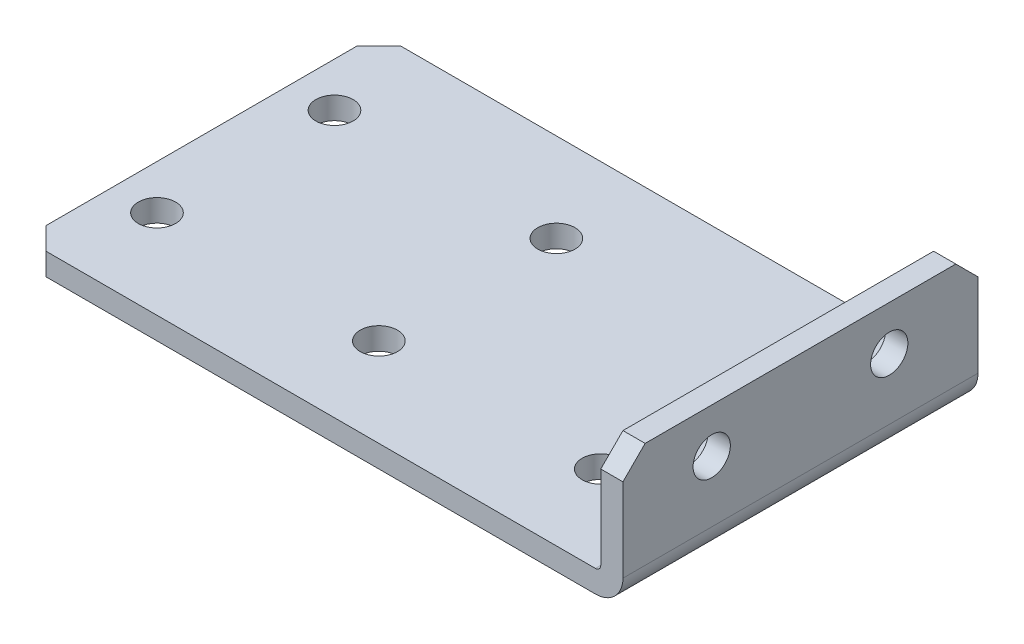
ISO-10303-21;
HEADER;
FILE_DESCRIPTION(('STEP AP214'),'2;1');
FILE_NAME('part.step','',(''),(''),'','','');
FILE_SCHEMA(('AUTOMOTIVE_DESIGN { 1 0 10303 214 1 1 1 1 }'));
ENDSEC;
DATA;
#1=APPLICATION_CONTEXT('core data for automotive mechanical design processes');
#2=APPLICATION_PROTOCOL_DEFINITION('international standard','automotive_design',2000,#1);
#3=PRODUCT_CONTEXT('',#1,'mechanical');
#4=PRODUCT('Part','Part','',(#3));
#5=PRODUCT_RELATED_PRODUCT_CATEGORY('part','',(#4));
#6=PRODUCT_DEFINITION_FORMATION('','',#4);
#7=PRODUCT_DEFINITION_CONTEXT('part definition',#1,'design');
#8=PRODUCT_DEFINITION('design','',#6,#7);
#9=PRODUCT_DEFINITION_SHAPE('','',#8);
#10=(LENGTH_UNIT() NAMED_UNIT(*) SI_UNIT(.MILLI.,.METRE.));
#11=(NAMED_UNIT(*) PLANE_ANGLE_UNIT() SI_UNIT($,.RADIAN.));
#12=(NAMED_UNIT(*) SI_UNIT($,.STERADIAN.) SOLID_ANGLE_UNIT());
#13=UNCERTAINTY_MEASURE_WITH_UNIT(LENGTH_MEASURE(1.E-05),#10,'distance_accuracy_value','');
#14=(GEOMETRIC_REPRESENTATION_CONTEXT(3) GLOBAL_UNCERTAINTY_ASSIGNED_CONTEXT((#13)) GLOBAL_UNIT_ASSIGNED_CONTEXT((#10,
#11,#12)) REPRESENTATION_CONTEXT('',''));
#15=CARTESIAN_POINT('',(0.,0.,0.));
#16=DIRECTION('',(0.,0.,1.));
#17=DIRECTION('',(1.,0.,0.));
#18=AXIS2_PLACEMENT_3D('',#15,#16,#17);
#19=CARTESIAN_POINT('',(85.7250000000001,12.7000000000001,-25.4));
#20=DIRECTION('',(-1.,0.,0.));
#21=DIRECTION('',(0.,-1.,0.));
#22=AXIS2_PLACEMENT_3D('',#19,#20,#21);
#23=CYLINDRICAL_SURFACE('',#22,2.667);
#24=CARTESIAN_POINT('',(85.7250000000001,12.7000000000001,-25.4));
#25=DIRECTION('',(-1.,0.,0.));
#26=DIRECTION('',(0.,-1.,0.));
#27=AXIS2_PLACEMENT_3D('',#24,#25,#26);
#28=CIRCLE('',#27,2.667);
#29=CARTESIAN_POINT('',(85.7250000000001,10.0330000000001,-25.4));
#30=VERTEX_POINT('',#29);
#31=EDGE_CURVE('E224',#30,#30,#28,.F.);
#32=ORIENTED_EDGE('',*,*,#31,.T.);
#33=EDGE_LOOP('',(#32));
#34=FACE_BOUND('',#33,.T.);
#35=CARTESIAN_POINT('',(82.55,12.7000000000001,-25.4));
#36=DIRECTION('',(-1.,0.,0.));
#37=DIRECTION('',(0.,-1.,0.));
#38=AXIS2_PLACEMENT_3D('',#35,#36,#37);
#39=CIRCLE('',#38,2.667);
#40=CARTESIAN_POINT('',(82.55,10.0330000000001,-25.4));
#41=VERTEX_POINT('',#40);
#42=EDGE_CURVE('E228',#41,#41,#39,.F.);
#43=ORIENTED_EDGE('',*,*,#42,.F.);
#44=EDGE_LOOP('',(#43));
#45=FACE_BOUND('',#44,.T.);
#46=ADVANCED_FACE('F16',(#34,#45),#23,.F.);
#47=CARTESIAN_POINT('',(85.7250000000001,12.7000000000001,-50.8));
#48=DIRECTION('',(-1.,0.,0.));
#49=DIRECTION('',(0.,-1.,0.));
#50=AXIS2_PLACEMENT_3D('',#47,#48,#49);
#51=CYLINDRICAL_SURFACE('',#50,2.667);
#52=CARTESIAN_POINT('',(85.7250000000001,12.7000000000001,-50.8));
#53=DIRECTION('',(-1.,0.,0.));
#54=DIRECTION('',(0.,-1.,0.));
#55=AXIS2_PLACEMENT_3D('',#52,#53,#54);
#56=CIRCLE('',#55,2.667);
#57=CARTESIAN_POINT('',(85.7250000000001,10.0330000000001,-50.8));
#58=VERTEX_POINT('',#57);
#59=EDGE_CURVE('E217',#58,#58,#56,.F.);
#60=ORIENTED_EDGE('',*,*,#59,.T.);
#61=EDGE_LOOP('',(#60));
#62=FACE_BOUND('',#61,.T.);
#63=CARTESIAN_POINT('',(82.55,12.7000000000001,-50.8));
#64=DIRECTION('',(-1.,0.,0.));
#65=DIRECTION('',(0.,-1.,0.));
#66=AXIS2_PLACEMENT_3D('',#63,#64,#65);
#67=CIRCLE('',#66,2.667);
#68=CARTESIAN_POINT('',(82.55,10.0330000000001,-50.8));
#69=VERTEX_POINT('',#68);
#70=EDGE_CURVE('E250',#69,#69,#67,.F.);
#71=ORIENTED_EDGE('',*,*,#70,.F.);
#72=EDGE_LOOP('',(#71));
#73=FACE_BOUND('',#72,.T.);
#74=ADVANCED_FACE('F423',(#62,#73),#51,.F.);
#75=CARTESIAN_POINT('',(85.7250000000001,19.05,0.));
#76=DIRECTION('',(0.,-1.,0.));
#77=DIRECTION('',(1.,0.,0.));
#78=AXIS2_PLACEMENT_3D('',#75,#76,#77);
#79=PLANE('',#78);
#80=DIRECTION('',(1.,0.,0.));
#81=VECTOR('',#80,1.);
#82=CARTESIAN_POINT('',(85.7250000000001,19.05,-60.325));
#83=LINE('',#82,#81);
#84=CARTESIAN_POINT('',(85.7250000000001,19.05,-60.325));
#85=VERTEX_POINT('',#84);
#86=CARTESIAN_POINT('',(82.5500000000001,19.05,-60.325));
#87=VERTEX_POINT('',#86);
#88=EDGE_CURVE('E241',#85,#87,#83,.F.);
#89=ORIENTED_EDGE('',*,*,#88,.T.);
#90=DIRECTION('',(0.,0.,1.));
#91=VECTOR('',#90,1.);
#92=CARTESIAN_POINT('',(82.5500000000001,19.05,0.));
#93=LINE('',#92,#91);
#94=CARTESIAN_POINT('',(82.55,19.05,-15.875));
#95=VERTEX_POINT('',#94);
#96=EDGE_CURVE('E251',#95,#87,#93,.F.);
#97=ORIENTED_EDGE('',*,*,#96,.F.);
#98=DIRECTION('',(1.,0.,0.));
#99=VECTOR('',#98,1.);
#100=CARTESIAN_POINT('',(85.7250000000001,19.05,-15.875));
#101=LINE('',#100,#99);
#102=CARTESIAN_POINT('',(85.7250000000001,19.05,-15.875));
#103=VERTEX_POINT('',#102);
#104=EDGE_CURVE('E225',#95,#103,#101,.T.);
#105=ORIENTED_EDGE('',*,*,#104,.T.);
#106=DIRECTION('',(0.,0.,1.));
#107=VECTOR('',#106,1.);
#108=CARTESIAN_POINT('',(85.7250000000001,19.05,0.));
#109=LINE('',#108,#107);
#110=EDGE_CURVE('E216',#103,#85,#109,.F.);
#111=ORIENTED_EDGE('',*,*,#110,.T.);
#112=EDGE_LOOP('',(#89,#97,#105,#111));
#113=FACE_BOUND('',#112,.T.);
#114=ADVANCED_FACE('F344',(#113),#79,.F.);
#115=CARTESIAN_POINT('',(85.7250000000001,19.05,-60.325));
#116=DIRECTION('',(0.,-0.707106781186548,0.707106781186548));
#117=DIRECTION('',(0.,-0.707106781186548,-0.707106781186548));
#118=AXIS2_PLACEMENT_3D('',#115,#116,#117);
#119=PLANE('',#118);
#120=DIRECTION('',(1.,0.,0.));
#121=VECTOR('',#120,1.);
#122=CARTESIAN_POINT('',(85.7250000000001,15.875,-63.5));
#123=LINE('',#122,#121);
#124=CARTESIAN_POINT('',(85.725,15.875,-63.5));
#125=VERTEX_POINT('',#124);
#126=CARTESIAN_POINT('',(82.55,15.875,-63.5));
#127=VERTEX_POINT('',#126);
#128=EDGE_CURVE('E137',#125,#127,#123,.F.);
#129=ORIENTED_EDGE('',*,*,#128,.T.);
#130=DIRECTION('',(0.,-0.707106781186545,-0.70710678118655));
#131=VECTOR('',#130,1.);
#132=CARTESIAN_POINT('',(82.5500000000001,19.05,-60.325));
#133=LINE('',#132,#131);
#134=EDGE_CURVE('E255',#87,#127,#133,.T.);
#135=ORIENTED_EDGE('',*,*,#134,.F.);
#136=ORIENTED_EDGE('',*,*,#88,.F.);
#137=DIRECTION('',(0.,-0.707106781186546,-0.707106781186549));
#138=VECTOR('',#137,1.);
#139=CARTESIAN_POINT('',(85.7250000000001,19.05,-60.325));
#140=LINE('',#139,#138);
#141=EDGE_CURVE('E234',#85,#125,#140,.T.);
#142=ORIENTED_EDGE('',*,*,#141,.T.);
#143=EDGE_LOOP('',(#129,#135,#136,#142));
#144=FACE_BOUND('',#143,.T.);
#145=ADVANCED_FACE('F341',(#144),#119,.F.);
#146=CARTESIAN_POINT('',(81.788,3.937,-63.5));
#147=DIRECTION('',(0.,0.,-1.));
#148=DIRECTION('',(-1.,0.,0.));
#149=AXIS2_PLACEMENT_3D('',#146,#147,#148);
#150=CYLINDRICAL_SURFACE('',#149,0.761999999999999);
#151=CARTESIAN_POINT('',(81.788,3.937,-12.7));
#152=DIRECTION('',(0.,0.,-1.));
#153=DIRECTION('',(-1.,0.,0.));
#154=AXIS2_PLACEMENT_3D('',#151,#152,#153);
#155=CIRCLE('',#154,0.761999999999999);
#156=CARTESIAN_POINT('',(82.55,3.937,-12.7));
#157=VERTEX_POINT('',#156);
#158=CARTESIAN_POINT('',(81.788,3.175,-12.7));
#159=VERTEX_POINT('',#158);
#160=EDGE_CURVE('E19',#157,#159,#155,.T.);
#161=ORIENTED_EDGE('',*,*,#160,.F.);
#162=DIRECTION('',(0.,0.,1.));
#163=VECTOR('',#162,1.);
#164=CARTESIAN_POINT('',(82.55,3.937,0.));
#165=LINE('',#164,#163);
#166=CARTESIAN_POINT('',(82.55,3.93699999999999,-63.5));
#167=VERTEX_POINT('',#166);
#168=EDGE_CURVE('E226',#167,#157,#165,.T.);
#169=ORIENTED_EDGE('',*,*,#168,.F.);
#170=CARTESIAN_POINT('',(81.788,3.937,-63.5));
#171=DIRECTION('',(0.,0.,-1.));
#172=DIRECTION('',(-1.,0.,0.));
#173=AXIS2_PLACEMENT_3D('',#170,#171,#172);
#174=CIRCLE('',#173,0.761999999999999);
#175=CARTESIAN_POINT('',(81.788,3.175,-63.5));
#176=VERTEX_POINT('',#175);
#177=EDGE_CURVE('E136',#167,#176,#174,.T.);
#178=ORIENTED_EDGE('',*,*,#177,.T.);
#179=DIRECTION('',(0.,0.,-1.));
#180=VECTOR('',#179,1.);
#181=CARTESIAN_POINT('',(81.788,3.175,-63.5));
#182=LINE('',#181,#180);
#183=EDGE_CURVE('E139',#176,#159,#182,.F.);
#184=ORIENTED_EDGE('',*,*,#183,.T.);
#185=EDGE_LOOP('',(#161,#169,#178,#184));
#186=FACE_BOUND('',#185,.T.);
#187=ADVANCED_FACE('F140',(#186),#150,.F.);
#188=CARTESIAN_POINT('',(82.5500000000001,19.05,0.));
#189=DIRECTION('',(-1.,0.,0.));
#190=DIRECTION('',(0.,-1.,0.));
#191=AXIS2_PLACEMENT_3D('',#188,#189,#190);
#192=PLANE('',#191);
#193=ORIENTED_EDGE('',*,*,#70,.T.);
#194=EDGE_LOOP('',(#193));
#195=FACE_BOUND('',#194,.T.);
#196=ORIENTED_EDGE('',*,*,#42,.T.);
#197=EDGE_LOOP('',(#196));
#198=FACE_BOUND('',#197,.T.);
#199=DIRECTION('',(0.,1.,0.));
#200=VECTOR('',#199,1.);
#201=CARTESIAN_POINT('',(82.55,0.,-12.7));
#202=LINE('',#201,#200);
#203=CARTESIAN_POINT('',(82.55,15.875,-12.7));
#204=VERTEX_POINT('',#203);
#205=EDGE_CURVE('E134',#157,#204,#202,.T.);
#206=ORIENTED_EDGE('',*,*,#205,.T.);
#207=DIRECTION('',(0.,0.707106781186549,-0.707106781186546));
#208=VECTOR('',#207,1.);
#209=CARTESIAN_POINT('',(82.55,19.05,-15.875));
#210=LINE('',#209,#208);
#211=EDGE_CURVE('E220',#204,#95,#210,.T.);
#212=ORIENTED_EDGE('',*,*,#211,.T.);
#213=ORIENTED_EDGE('',*,*,#96,.T.);
#214=ORIENTED_EDGE('',*,*,#134,.T.);
#215=DIRECTION('',(0.,-1.,0.));
#216=VECTOR('',#215,1.);
#217=CARTESIAN_POINT('',(82.5500000000001,19.05,-63.5));
#218=LINE('',#217,#216);
#219=EDGE_CURVE('E229',#127,#167,#218,.T.);
#220=ORIENTED_EDGE('',*,*,#219,.T.);
#221=ORIENTED_EDGE('',*,*,#168,.T.);
#222=EDGE_LOOP('',(#206,#212,#213,#214,#220,#221));
#223=FACE_BOUND('',#222,.T.);
#224=ADVANCED_FACE('F350',(#195,#198,#223),#192,.T.);
#225=CARTESIAN_POINT('',(85.7250000000001,19.05,-15.875));
#226=DIRECTION('',(0.,-0.707106781186546,-0.707106781186549));
#227=DIRECTION('',(0.,0.707106781186549,-0.707106781186546));
#228=AXIS2_PLACEMENT_3D('',#225,#226,#227);
#229=PLANE('',#228);
#230=DIRECTION('',(-1.,0.,0.));
#231=VECTOR('',#230,1.);
#232=CARTESIAN_POINT('',(-9.42940188980387,15.875,-12.7));
#233=LINE('',#232,#231);
#234=CARTESIAN_POINT('',(85.725,15.875,-12.7));
#235=VERTEX_POINT('',#234);
#236=EDGE_CURVE('E158',#204,#235,#233,.F.);
#237=ORIENTED_EDGE('',*,*,#236,.T.);
#238=DIRECTION('',(0.,0.707106781186549,-0.707106781186546));
#239=VECTOR('',#238,1.);
#240=CARTESIAN_POINT('',(85.725,15.875,-12.7));
#241=LINE('',#240,#239);
#242=EDGE_CURVE('E212',#235,#103,#241,.T.);
#243=ORIENTED_EDGE('',*,*,#242,.T.);
#244=ORIENTED_EDGE('',*,*,#104,.F.);
#245=ORIENTED_EDGE('',*,*,#211,.F.);
#246=EDGE_LOOP('',(#237,#243,#244,#245));
#247=FACE_BOUND('',#246,.T.);
#248=ADVANCED_FACE('F348',(#247),#229,.F.);
#249=CARTESIAN_POINT('',(85.7250000000001,19.05,0.));
#250=DIRECTION('',(-1.,0.,0.));
#251=DIRECTION('',(0.,-1.,0.));
#252=AXIS2_PLACEMENT_3D('',#249,#250,#251);
#253=PLANE('',#252);
#254=ORIENTED_EDGE('',*,*,#141,.F.);
#255=ORIENTED_EDGE('',*,*,#110,.F.);
#256=ORIENTED_EDGE('',*,*,#242,.F.);
#257=DIRECTION('',(0.,1.,0.));
#258=VECTOR('',#257,1.);
#259=CARTESIAN_POINT('',(85.725,0.,-12.7));
#260=LINE('',#259,#258);
#261=CARTESIAN_POINT('',(85.725,3.93699999999999,-12.7));
#262=VERTEX_POINT('',#261);
#263=EDGE_CURVE('E182',#235,#262,#260,.F.);
#264=ORIENTED_EDGE('',*,*,#263,.T.);
#265=DIRECTION('',(0.,0.,-1.));
#266=VECTOR('',#265,1.);
#267=CARTESIAN_POINT('',(85.725,3.93699999999999,-63.5));
#268=LINE('',#267,#266);
#269=CARTESIAN_POINT('',(85.725,3.93699999999999,-63.5));
#270=VERTEX_POINT('',#269);
#271=EDGE_CURVE('E161',#270,#262,#268,.F.);
#272=ORIENTED_EDGE('',*,*,#271,.F.);
#273=DIRECTION('',(0.,-1.,0.));
#274=VECTOR('',#273,1.);
#275=CARTESIAN_POINT('',(85.7250000000001,19.05,-63.5));
#276=LINE('',#275,#274);
#277=EDGE_CURVE('E146',#125,#270,#276,.T.);
#278=ORIENTED_EDGE('',*,*,#277,.F.);
#279=EDGE_LOOP('',(#254,#255,#256,#264,#272,#278));
#280=FACE_BOUND('',#279,.T.);
#281=ORIENTED_EDGE('',*,*,#59,.F.);
#282=EDGE_LOOP('',(#281));
#283=FACE_BOUND('',#282,.T.);
#284=ORIENTED_EDGE('',*,*,#31,.F.);
#285=EDGE_LOOP('',(#284));
#286=FACE_BOUND('',#285,.T.);
#287=ADVANCED_FACE('F326',(#280,#283,#286),#253,.F.);
#288=CARTESIAN_POINT('',(0.,3.175,-63.5));
#289=DIRECTION('',(0.,-1.,0.));
#290=DIRECTION('',(0.,0.,-1.));
#291=AXIS2_PLACEMENT_3D('',#288,#289,#290);
#292=PLANE('',#291);
#293=DIRECTION('',(0.707106781186548,0.,-0.707106781186548));
#294=VECTOR('',#293,1.);
#295=CARTESIAN_POINT('',(3.17500000000001,3.175,-63.5));
#296=LINE('',#295,#294);
#297=CARTESIAN_POINT('',(3.17500000000001,3.175,-63.5));
#298=VERTEX_POINT('',#297);
#299=CARTESIAN_POINT('',(0.,3.175,-60.325));
#300=VERTEX_POINT('',#299);
#301=EDGE_CURVE('E199',#298,#300,#296,.F.);
#302=ORIENTED_EDGE('',*,*,#301,.T.);
#303=DIRECTION('',(0.,0.,-1.));
#304=VECTOR('',#303,1.);
#305=CARTESIAN_POINT('',(0.,3.175,0.));
#306=LINE('',#305,#304);
#307=CARTESIAN_POINT('',(0.,3.175,-15.875));
#308=VERTEX_POINT('',#307);
#309=EDGE_CURVE('E145',#300,#308,#306,.F.);
#310=ORIENTED_EDGE('',*,*,#309,.T.);
#311=DIRECTION('',(-0.707106781186548,0.,-0.707106781186547));
#312=VECTOR('',#311,1.);
#313=CARTESIAN_POINT('',(3.17500000000001,3.175,-12.7));
#314=LINE('',#313,#312);
#315=CARTESIAN_POINT('',(3.17500000000001,3.175,-12.7));
#316=VERTEX_POINT('',#315);
#317=EDGE_CURVE('E151',#308,#316,#314,.F.);
#318=ORIENTED_EDGE('',*,*,#317,.T.);
#319=DIRECTION('',(-1.,0.,0.));
#320=VECTOR('',#319,1.);
#321=CARTESIAN_POINT('',(-9.42940188980387,3.175,-12.7));
#322=LINE('',#321,#320);
#323=EDGE_CURVE('E132',#316,#159,#322,.F.);
#324=ORIENTED_EDGE('',*,*,#323,.T.);
#325=ORIENTED_EDGE('',*,*,#183,.F.);
#326=DIRECTION('',(1.,0.,0.));
#327=VECTOR('',#326,1.);
#328=CARTESIAN_POINT('',(0.,3.175,-63.5));
#329=LINE('',#328,#327);
#330=EDGE_CURVE('E191',#176,#298,#329,.F.);
#331=ORIENTED_EDGE('',*,*,#330,.T.);
#332=EDGE_LOOP('',(#302,#310,#318,#324,#325,#331));
#333=FACE_BOUND('',#332,.T.);
#334=CARTESIAN_POINT('',(6.34999999999999,3.175,-50.8));
#335=DIRECTION('',(0.,1.,0.));
#336=DIRECTION('',(0.,0.,1.));
#337=AXIS2_PLACEMENT_3D('',#334,#335,#336);
#338=CIRCLE('',#337,2.667);
#339=CARTESIAN_POINT('',(6.34999999999999,3.175,-48.133));
#340=VERTEX_POINT('',#339);
#341=EDGE_CURVE('E203',#340,#340,#338,.F.);
#342=ORIENTED_EDGE('',*,*,#341,.T.);
#343=EDGE_LOOP('',(#342));
#344=FACE_BOUND('',#343,.T.);
#345=CARTESIAN_POINT('',(6.35,3.175,-25.4));
#346=DIRECTION('',(0.,1.,0.));
#347=DIRECTION('',(0.,0.,1.));
#348=AXIS2_PLACEMENT_3D('',#345,#346,#347);
#349=CIRCLE('',#348,2.667);
#350=CARTESIAN_POINT('',(6.35,3.175,-22.733));
#351=VERTEX_POINT('',#350);
#352=EDGE_CURVE('E282',#351,#351,#349,.F.);
#353=ORIENTED_EDGE('',*,*,#352,.T.);
#354=EDGE_LOOP('',(#353));
#355=FACE_BOUND('',#354,.T.);
#356=CARTESIAN_POINT('',(69.85,3.175,-50.8));
#357=DIRECTION('',(0.,1.,0.));
#358=DIRECTION('',(0.,0.,1.));
#359=AXIS2_PLACEMENT_3D('',#356,#357,#358);
#360=CIRCLE('',#359,2.667);
#361=CARTESIAN_POINT('',(69.85,3.175,-48.133));
#362=VERTEX_POINT('',#361);
#363=EDGE_CURVE('E286',#362,#362,#360,.F.);
#364=ORIENTED_EDGE('',*,*,#363,.T.);
#365=EDGE_LOOP('',(#364));
#366=FACE_BOUND('',#365,.T.);
#367=CARTESIAN_POINT('',(69.85,3.175,-25.4));
#368=DIRECTION('',(0.,1.,0.));
#369=DIRECTION('',(0.,0.,1.));
#370=AXIS2_PLACEMENT_3D('',#367,#368,#369);
#371=CIRCLE('',#370,2.667);
#372=CARTESIAN_POINT('',(69.85,3.175,-22.733));
#373=VERTEX_POINT('',#372);
#374=EDGE_CURVE('E290',#373,#373,#371,.F.);
#375=ORIENTED_EDGE('',*,*,#374,.T.);
#376=EDGE_LOOP('',(#375));
#377=FACE_BOUND('',#376,.T.);
#378=CARTESIAN_POINT('',(38.1,3.175,-50.8));
#379=DIRECTION('',(0.,1.,0.));
#380=DIRECTION('',(0.,0.,1.));
#381=AXIS2_PLACEMENT_3D('',#378,#379,#380);
#382=CIRCLE('',#381,2.667);
#383=CARTESIAN_POINT('',(38.1,3.175,-48.133));
#384=VERTEX_POINT('',#383);
#385=EDGE_CURVE('E294',#384,#384,#382,.F.);
#386=ORIENTED_EDGE('',*,*,#385,.T.);
#387=EDGE_LOOP('',(#386));
#388=FACE_BOUND('',#387,.T.);
#389=CARTESIAN_POINT('',(38.1,3.175,-25.4));
#390=DIRECTION('',(0.,1.,0.));
#391=DIRECTION('',(0.,0.,1.));
#392=AXIS2_PLACEMENT_3D('',#389,#390,#391);
#393=CIRCLE('',#392,2.667);
#394=CARTESIAN_POINT('',(38.1,3.175,-22.733));
#395=VERTEX_POINT('',#394);
#396=EDGE_CURVE('E211',#395,#395,#393,.F.);
#397=ORIENTED_EDGE('',*,*,#396,.T.);
#398=EDGE_LOOP('',(#397));
#399=FACE_BOUND('',#398,.T.);
#400=ADVANCED_FACE('F148',(#333,#344,#355,#366,#377,#388,#399),#292,.F.);
#401=CARTESIAN_POINT('',(0.,3.175,0.));
#402=DIRECTION('',(1.,0.,0.));
#403=DIRECTION('',(0.,0.,-1.));
#404=AXIS2_PLACEMENT_3D('',#401,#402,#403);
#405=PLANE('',#404);
#406=DIRECTION('',(0.,1.,0.));
#407=VECTOR('',#406,1.);
#408=CARTESIAN_POINT('',(0.,3.175,-60.325));
#409=LINE('',#408,#407);
#410=CARTESIAN_POINT('',(0.,0.,-60.325));
#411=VERTEX_POINT('',#410);
#412=EDGE_CURVE('E196',#300,#411,#409,.F.);
#413=ORIENTED_EDGE('',*,*,#412,.T.);
#414=DIRECTION('',(0.,0.,-1.));
#415=VECTOR('',#414,1.);
#416=CARTESIAN_POINT('',(0.,0.,-63.5));
#417=LINE('',#416,#415);
#418=CARTESIAN_POINT('',(0.,0.,-15.875));
#419=VERTEX_POINT('',#418);
#420=EDGE_CURVE('E195',#419,#411,#417,.T.);
#421=ORIENTED_EDGE('',*,*,#420,.F.);
#422=DIRECTION('',(0.,1.,0.));
#423=VECTOR('',#422,1.);
#424=CARTESIAN_POINT('',(0.,0.,-15.875));
#425=LINE('',#424,#423);
#426=EDGE_CURVE('E181',#419,#308,#425,.T.);
#427=ORIENTED_EDGE('',*,*,#426,.T.);
#428=ORIENTED_EDGE('',*,*,#309,.F.);
#429=EDGE_LOOP('',(#413,#421,#427,#428));
#430=FACE_BOUND('',#429,.T.);
#431=ADVANCED_FACE('F359',(#430),#405,.F.);
#432=CARTESIAN_POINT('',(3.17500000000001,3.175,-63.5));
#433=DIRECTION('',(0.707106781186548,0.,0.707106781186548));
#434=DIRECTION('',(0.707106781186548,0.,-0.707106781186548));
#435=AXIS2_PLACEMENT_3D('',#432,#433,#434);
#436=PLANE('',#435);
#437=ORIENTED_EDGE('',*,*,#412,.F.);
#438=ORIENTED_EDGE('',*,*,#301,.F.);
#439=DIRECTION('',(0.,1.,0.));
#440=VECTOR('',#439,1.);
#441=CARTESIAN_POINT('',(3.17500000000001,3.175,-63.5));
#442=LINE('',#441,#440);
#443=CARTESIAN_POINT('',(3.17500000000001,0.,-63.5));
#444=VERTEX_POINT('',#443);
#445=EDGE_CURVE('E187',#298,#444,#442,.F.);
#446=ORIENTED_EDGE('',*,*,#445,.T.);
#447=DIRECTION('',(0.707106781186547,0.,-0.707106781186548));
#448=VECTOR('',#447,1.);
#449=CARTESIAN_POINT('',(0.,0.,-60.325));
#450=LINE('',#449,#448);
#451=EDGE_CURVE('E186',#411,#444,#450,.T.);
#452=ORIENTED_EDGE('',*,*,#451,.F.);
#453=EDGE_LOOP('',(#437,#438,#446,#452));
#454=FACE_BOUND('',#453,.T.);
#455=ADVANCED_FACE('F355',(#454),#436,.F.);
#456=CARTESIAN_POINT('',(0.,3.175,-63.5));
#457=DIRECTION('',(0.,0.,1.));
#458=DIRECTION('',(1.,0.,0.));
#459=AXIS2_PLACEMENT_3D('',#456,#457,#458);
#460=PLANE('',#459);
#461=ORIENTED_EDGE('',*,*,#445,.F.);
#462=ORIENTED_EDGE('',*,*,#330,.F.);
#463=ORIENTED_EDGE('',*,*,#177,.F.);
#464=ORIENTED_EDGE('',*,*,#219,.F.);
#465=ORIENTED_EDGE('',*,*,#128,.F.);
#466=ORIENTED_EDGE('',*,*,#277,.T.);
#467=CARTESIAN_POINT('',(81.788,3.937,-63.5));
#468=DIRECTION('',(0.,0.,-1.));
#469=DIRECTION('',(-1.,0.,0.));
#470=AXIS2_PLACEMENT_3D('',#467,#468,#469);
#471=CIRCLE('',#470,3.937);
#472=CARTESIAN_POINT('',(81.788,0.,-63.5));
#473=VERTEX_POINT('',#472);
#474=EDGE_CURVE('E190',#473,#270,#471,.F.);
#475=ORIENTED_EDGE('',*,*,#474,.F.);
#476=DIRECTION('',(1.,0.,0.));
#477=VECTOR('',#476,1.);
#478=CARTESIAN_POINT('',(0.,0.,-63.5));
#479=LINE('',#478,#477);
#480=EDGE_CURVE('E170',#444,#473,#479,.T.);
#481=ORIENTED_EDGE('',*,*,#480,.F.);
#482=EDGE_LOOP('',(#461,#462,#463,#464,#465,#466,#475,#481));
#483=FACE_BOUND('',#482,.T.);
#484=ADVANCED_FACE('F336',(#483),#460,.F.);
#485=CARTESIAN_POINT('',(81.788,3.937,-63.5));
#486=DIRECTION('',(0.,0.,-1.));
#487=DIRECTION('',(-1.,0.,0.));
#488=AXIS2_PLACEMENT_3D('',#485,#486,#487);
#489=CYLINDRICAL_SURFACE('',#488,3.937);
#490=ORIENTED_EDGE('',*,*,#474,.T.);
#491=ORIENTED_EDGE('',*,*,#271,.T.);
#492=CARTESIAN_POINT('',(81.788,3.937,-12.7));
#493=DIRECTION('',(0.,0.,-1.));
#494=DIRECTION('',(-1.,0.,0.));
#495=AXIS2_PLACEMENT_3D('',#492,#493,#494);
#496=CIRCLE('',#495,3.937);
#497=CARTESIAN_POINT('',(81.788,0.,-12.7));
#498=VERTEX_POINT('',#497);
#499=EDGE_CURVE('E153',#262,#498,#496,.T.);
#500=ORIENTED_EDGE('',*,*,#499,.T.);
#501=DIRECTION('',(0.,0.,-1.));
#502=VECTOR('',#501,1.);
#503=CARTESIAN_POINT('',(81.788,0.,-63.5));
#504=LINE('',#503,#502);
#505=EDGE_CURVE('E165',#473,#498,#504,.F.);
#506=ORIENTED_EDGE('',*,*,#505,.F.);
#507=EDGE_LOOP('',(#490,#491,#500,#506));
#508=FACE_BOUND('',#507,.T.);
#509=ADVANCED_FACE('F332',(#508),#489,.T.);
#510=CARTESIAN_POINT('',(-9.42940188980387,0.,-12.7));
#511=DIRECTION('',(0.,0.,-1.));
#512=DIRECTION('',(-1.,0.,0.));
#513=AXIS2_PLACEMENT_3D('',#510,#511,#512);
#514=PLANE('',#513);
#515=ORIENTED_EDGE('',*,*,#236,.F.);
#516=ORIENTED_EDGE('',*,*,#205,.F.);
#517=ORIENTED_EDGE('',*,*,#160,.T.);
#518=ORIENTED_EDGE('',*,*,#323,.F.);
#519=DIRECTION('',(0.,1.,0.));
#520=VECTOR('',#519,1.);
#521=CARTESIAN_POINT('',(3.17500000000001,0.,-12.7));
#522=LINE('',#521,#520);
#523=CARTESIAN_POINT('',(3.17500000000001,0.,-12.7));
#524=VERTEX_POINT('',#523);
#525=EDGE_CURVE('E39',#316,#524,#522,.F.);
#526=ORIENTED_EDGE('',*,*,#525,.T.);
#527=DIRECTION('',(1.,0.,0.));
#528=VECTOR('',#527,1.);
#529=CARTESIAN_POINT('',(0.,0.,-12.7));
#530=LINE('',#529,#528);
#531=EDGE_CURVE('E169',#498,#524,#530,.F.);
#532=ORIENTED_EDGE('',*,*,#531,.F.);
#533=ORIENTED_EDGE('',*,*,#499,.F.);
#534=ORIENTED_EDGE('',*,*,#263,.F.);
#535=EDGE_LOOP('',(#515,#516,#517,#518,#526,#532,#533,#534));
#536=FACE_BOUND('',#535,.T.);
#537=ADVANCED_FACE('F130',(#536),#514,.F.);
#538=CARTESIAN_POINT('',(3.17500000000001,0.,-12.7));
#539=DIRECTION('',(0.707106781186547,0.,-0.707106781186548));
#540=DIRECTION('',(-0.707106781186548,0.,-0.707106781186547));
#541=AXIS2_PLACEMENT_3D('',#538,#539,#540);
#542=PLANE('',#541);
#543=ORIENTED_EDGE('',*,*,#426,.F.);
#544=DIRECTION('',(-0.707106781186547,0.,-0.707106781186548));
#545=VECTOR('',#544,1.);
#546=CARTESIAN_POINT('',(3.17500000000001,0.,-12.7));
#547=LINE('',#546,#545);
#548=EDGE_CURVE('E174',#524,#419,#547,.T.);
#549=ORIENTED_EDGE('',*,*,#548,.F.);
#550=ORIENTED_EDGE('',*,*,#525,.F.);
#551=ORIENTED_EDGE('',*,*,#317,.F.);
#552=EDGE_LOOP('',(#543,#549,#550,#551));
#553=FACE_BOUND('',#552,.T.);
#554=ADVANCED_FACE('F362',(#553),#542,.F.);
#555=CARTESIAN_POINT('',(38.1,0.,-25.4));
#556=DIRECTION('',(0.,1.,0.));
#557=DIRECTION('',(0.,0.,1.));
#558=AXIS2_PLACEMENT_3D('',#555,#556,#557);
#559=CYLINDRICAL_SURFACE('',#558,2.667);
#560=ORIENTED_EDGE('',*,*,#396,.F.);
#561=EDGE_LOOP('',(#560));
#562=FACE_BOUND('',#561,.T.);
#563=CARTESIAN_POINT('',(38.1,0.,-25.4));
#564=DIRECTION('',(0.,1.,0.));
#565=DIRECTION('',(0.,0.,1.));
#566=AXIS2_PLACEMENT_3D('',#563,#564,#565);
#567=CIRCLE('',#566,2.667);
#568=CARTESIAN_POINT('',(38.1,0.,-22.733));
#569=VERTEX_POINT('',#568);
#570=EDGE_CURVE('E178',#569,#569,#567,.T.);
#571=ORIENTED_EDGE('',*,*,#570,.F.);
#572=EDGE_LOOP('',(#571));
#573=FACE_BOUND('',#572,.T.);
#574=ADVANCED_FACE('F392',(#562,#573),#559,.F.);
#575=CARTESIAN_POINT('',(38.1,0.,-50.8));
#576=DIRECTION('',(0.,1.,0.));
#577=DIRECTION('',(0.,0.,1.));
#578=AXIS2_PLACEMENT_3D('',#575,#576,#577);
#579=CYLINDRICAL_SURFACE('',#578,2.667);
#580=ORIENTED_EDGE('',*,*,#385,.F.);
#581=EDGE_LOOP('',(#580));
#582=FACE_BOUND('',#581,.T.);
#583=CARTESIAN_POINT('',(38.1,0.,-50.8));
#584=DIRECTION('',(0.,1.,0.));
#585=DIRECTION('',(0.,0.,1.));
#586=AXIS2_PLACEMENT_3D('',#583,#584,#585);
#587=CIRCLE('',#586,2.667);
#588=CARTESIAN_POINT('',(38.1,0.,-48.133));
#589=VERTEX_POINT('',#588);
#590=EDGE_CURVE('E272',#589,#589,#587,.T.);
#591=ORIENTED_EDGE('',*,*,#590,.F.);
#592=EDGE_LOOP('',(#591));
#593=FACE_BOUND('',#592,.T.);
#594=ADVANCED_FACE('F388',(#582,#593),#579,.F.);
#595=CARTESIAN_POINT('',(69.85,0.,-25.4));
#596=DIRECTION('',(0.,1.,0.));
#597=DIRECTION('',(0.,0.,1.));
#598=AXIS2_PLACEMENT_3D('',#595,#596,#597);
#599=CYLINDRICAL_SURFACE('',#598,2.667);
#600=ORIENTED_EDGE('',*,*,#374,.F.);
#601=EDGE_LOOP('',(#600));
#602=FACE_BOUND('',#601,.T.);
#603=CARTESIAN_POINT('',(69.85,0.,-25.4));
#604=DIRECTION('',(0.,1.,0.));
#605=DIRECTION('',(0.,0.,1.));
#606=AXIS2_PLACEMENT_3D('',#603,#604,#605);
#607=CIRCLE('',#606,2.667);
#608=CARTESIAN_POINT('',(69.85,0.,-22.733));
#609=VERTEX_POINT('',#608);
#610=EDGE_CURVE('E268',#609,#609,#607,.T.);
#611=ORIENTED_EDGE('',*,*,#610,.F.);
#612=EDGE_LOOP('',(#611));
#613=FACE_BOUND('',#612,.T.);
#614=ADVANCED_FACE('F384',(#602,#613),#599,.F.);
#615=CARTESIAN_POINT('',(69.85,0.,-50.8));
#616=DIRECTION('',(0.,1.,0.));
#617=DIRECTION('',(0.,0.,1.));
#618=AXIS2_PLACEMENT_3D('',#615,#616,#617);
#619=CYLINDRICAL_SURFACE('',#618,2.667);
#620=ORIENTED_EDGE('',*,*,#363,.F.);
#621=EDGE_LOOP('',(#620));
#622=FACE_BOUND('',#621,.T.);
#623=CARTESIAN_POINT('',(69.85,0.,-50.8));
#624=DIRECTION('',(0.,1.,0.));
#625=DIRECTION('',(0.,0.,1.));
#626=AXIS2_PLACEMENT_3D('',#623,#624,#625);
#627=CIRCLE('',#626,2.667);
#628=CARTESIAN_POINT('',(69.85,0.,-48.133));
#629=VERTEX_POINT('',#628);
#630=EDGE_CURVE('E264',#629,#629,#627,.T.);
#631=ORIENTED_EDGE('',*,*,#630,.F.);
#632=EDGE_LOOP('',(#631));
#633=FACE_BOUND('',#632,.T.);
#634=ADVANCED_FACE('F380',(#622,#633),#619,.F.);
#635=CARTESIAN_POINT('',(6.35,0.,-25.4));
#636=DIRECTION('',(0.,1.,0.));
#637=DIRECTION('',(0.,0.,1.));
#638=AXIS2_PLACEMENT_3D('',#635,#636,#637);
#639=CYLINDRICAL_SURFACE('',#638,2.667);
#640=ORIENTED_EDGE('',*,*,#352,.F.);
#641=EDGE_LOOP('',(#640));
#642=FACE_BOUND('',#641,.T.);
#643=CARTESIAN_POINT('',(6.35,0.,-25.4));
#644=DIRECTION('',(0.,1.,0.));
#645=DIRECTION('',(0.,0.,1.));
#646=AXIS2_PLACEMENT_3D('',#643,#644,#645);
#647=CIRCLE('',#646,2.667);
#648=CARTESIAN_POINT('',(6.35,0.,-22.733));
#649=VERTEX_POINT('',#648);
#650=EDGE_CURVE('E26',#649,#649,#647,.T.);
#651=ORIENTED_EDGE('',*,*,#650,.F.);
#652=EDGE_LOOP('',(#651));
#653=FACE_BOUND('',#652,.T.);
#654=ADVANCED_FACE('F373',(#642,#653),#639,.F.);
#655=CARTESIAN_POINT('',(6.34999999999999,0.,-50.8));
#656=DIRECTION('',(0.,1.,0.));
#657=DIRECTION('',(0.,0.,1.));
#658=AXIS2_PLACEMENT_3D('',#655,#656,#657);
#659=CYLINDRICAL_SURFACE('',#658,2.667);
#660=ORIENTED_EDGE('',*,*,#341,.F.);
#661=EDGE_LOOP('',(#660));
#662=FACE_BOUND('',#661,.T.);
#663=CARTESIAN_POINT('',(6.34999999999999,0.,-50.8));
#664=DIRECTION('',(0.,1.,0.));
#665=DIRECTION('',(0.,0.,1.));
#666=AXIS2_PLACEMENT_3D('',#663,#664,#665);
#667=CIRCLE('',#666,2.667);
#668=CARTESIAN_POINT('',(6.34999999999999,0.,-48.133));
#669=VERTEX_POINT('',#668);
#670=EDGE_CURVE('E11',#669,#669,#667,.T.);
#671=ORIENTED_EDGE('',*,*,#670,.F.);
#672=EDGE_LOOP('',(#671));
#673=FACE_BOUND('',#672,.T.);
#674=ADVANCED_FACE('F366',(#662,#673),#659,.F.);
#675=CARTESIAN_POINT('',(0.,0.,-63.5));
#676=DIRECTION('',(0.,-1.,0.));
#677=DIRECTION('',(0.,0.,-1.));
#678=AXIS2_PLACEMENT_3D('',#675,#676,#677);
#679=PLANE('',#678);
#680=ORIENTED_EDGE('',*,*,#670,.T.);
#681=EDGE_LOOP('',(#680));
#682=FACE_BOUND('',#681,.T.);
#683=ORIENTED_EDGE('',*,*,#650,.T.);
#684=EDGE_LOOP('',(#683));
#685=FACE_BOUND('',#684,.T.);
#686=ORIENTED_EDGE('',*,*,#630,.T.);
#687=EDGE_LOOP('',(#686));
#688=FACE_BOUND('',#687,.T.);
#689=ORIENTED_EDGE('',*,*,#610,.T.);
#690=EDGE_LOOP('',(#689));
#691=FACE_BOUND('',#690,.T.);
#692=ORIENTED_EDGE('',*,*,#590,.T.);
#693=EDGE_LOOP('',(#692));
#694=FACE_BOUND('',#693,.T.);
#695=ORIENTED_EDGE('',*,*,#570,.T.);
#696=EDGE_LOOP('',(#695));
#697=FACE_BOUND('',#696,.T.);
#698=ORIENTED_EDGE('',*,*,#531,.T.);
#699=ORIENTED_EDGE('',*,*,#548,.T.);
#700=ORIENTED_EDGE('',*,*,#420,.T.);
#701=ORIENTED_EDGE('',*,*,#451,.T.);
#702=ORIENTED_EDGE('',*,*,#480,.T.);
#703=ORIENTED_EDGE('',*,*,#505,.T.);
#704=EDGE_LOOP('',(#698,#699,#700,#701,#702,#703));
#705=FACE_BOUND('',#704,.T.);
#706=ADVANCED_FACE('F364',(#682,#685,#688,#691,#694,#697,#705),#679,.T.);
#707=CLOSED_SHELL('',(#46,#74,#114,#145,#187,#224,#248,#287,#400,#431,#455,#484,#509,#537,#554,
#574,#594,#614,#634,#654,#674,#706));
#708=MANIFOLD_SOLID_BREP('B1',#707);
#709=ADVANCED_BREP_SHAPE_REPRESENTATION('',(#18,#708),#14);
#710=SHAPE_DEFINITION_REPRESENTATION(#9,#709);
ENDSEC;
END-ISO-10303-21;
